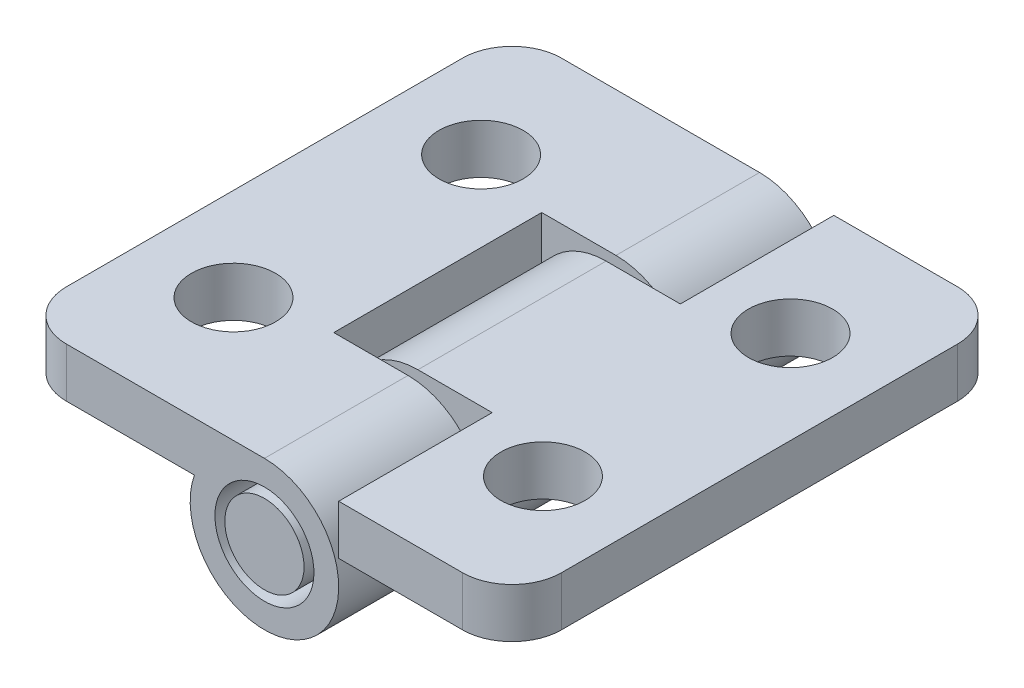
ISO-10303-21;
HEADER;
FILE_DESCRIPTION(('STEP AP214'),'2;1');
FILE_NAME('part.step','',(''),(''),'','','');
FILE_SCHEMA(('AUTOMOTIVE_DESIGN { 1 0 10303 214 1 1 1 1 }'));
ENDSEC;
DATA;
#1=APPLICATION_CONTEXT('core data for automotive mechanical design processes');
#2=APPLICATION_PROTOCOL_DEFINITION('international standard','automotive_design',2000,#1);
#3=PRODUCT_CONTEXT('',#1,'mechanical');
#4=PRODUCT('Part','Part','',(#3));
#5=PRODUCT_RELATED_PRODUCT_CATEGORY('part','',(#4));
#6=PRODUCT_DEFINITION_FORMATION('','',#4);
#7=PRODUCT_DEFINITION_CONTEXT('part definition',#1,'design');
#8=PRODUCT_DEFINITION('design','',#6,#7);
#9=PRODUCT_DEFINITION_SHAPE('','',#8);
#10=(LENGTH_UNIT() NAMED_UNIT(*) SI_UNIT(.MILLI.,.METRE.));
#11=(NAMED_UNIT(*) PLANE_ANGLE_UNIT() SI_UNIT($,.RADIAN.));
#12=(NAMED_UNIT(*) SI_UNIT($,.STERADIAN.) SOLID_ANGLE_UNIT());
#13=UNCERTAINTY_MEASURE_WITH_UNIT(LENGTH_MEASURE(1.E-05),#10,'distance_accuracy_value','');
#14=(GEOMETRIC_REPRESENTATION_CONTEXT(3) GLOBAL_UNCERTAINTY_ASSIGNED_CONTEXT((#13)) GLOBAL_UNIT_ASSIGNED_CONTEXT((#10,
#11,#12)) REPRESENTATION_CONTEXT('',''));
#15=CARTESIAN_POINT('',(0.,0.,0.));
#16=DIRECTION('',(0.,0.,1.));
#17=DIRECTION('',(1.,0.,0.));
#18=AXIS2_PLACEMENT_3D('',#15,#16,#17);
#19=CARTESIAN_POINT('',(204.233210021912,-9.42872218613201,230.693757069305));
#20=DIRECTION('',(0.,0.,1.));
#21=DIRECTION('',(1.,0.,0.));
#22=AXIS2_PLACEMENT_3D('',#19,#20,#21);
#23=PLANE('',#22);
#24=CARTESIAN_POINT('',(204.233210021912,-9.42872218613201,230.693757069305));
#25=DIRECTION('',(0.,0.,-1.));
#26=DIRECTION('',(1.,0.,0.));
#27=AXIS2_PLACEMENT_3D('',#24,#25,#26);
#28=CIRCLE('',#27,2.);
#29=CARTESIAN_POINT('',(206.233210021912,-9.42872218613201,230.693757069305));
#30=VERTEX_POINT('',#29);
#31=EDGE_CURVE('P0_E227',#30,#30,#28,.T.);
#32=ORIENTED_EDGE('',*,*,#31,.T.);
#33=EDGE_LOOP('',(#32));
#34=FACE_BOUND('',#33,.T.);
#35=CARTESIAN_POINT('',(204.233210021912,-9.42872218613201,230.693757069305));
#36=DIRECTION('',(0.,0.,1.));
#37=DIRECTION('',(1.,0.,0.));
#38=AXIS2_PLACEMENT_3D('',#35,#36,#37);
#39=CIRCLE('',#38,3.);
#40=CARTESIAN_POINT('',(201.404782897166,-8.42872218613201,230.693757069305));
#41=VERTEX_POINT('',#40);
#42=CARTESIAN_POINT('',(204.233210021912,-6.42872218613202,230.693757069305));
#43=VERTEX_POINT('',#42);
#44=EDGE_CURVE('P0_E235',#41,#43,#39,.T.);
#45=ORIENTED_EDGE('',*,*,#44,.T.);
#46=DIRECTION('',(-1.,0.,0.));
#47=VECTOR('',#46,1.);
#48=CARTESIAN_POINT('',(204.233210021912,-6.42872218613202,230.693757069305));
#49=LINE('',#48,#47);
#50=CARTESIAN_POINT('',(201.233210021912,-6.42872218613201,230.693757069305));
#51=VERTEX_POINT('',#50);
#52=EDGE_CURVE('P0_E112',#43,#51,#49,.T.);
#53=ORIENTED_EDGE('',*,*,#52,.T.);
#54=DIRECTION('',(0.,-1.,0.));
#55=VECTOR('',#54,1.);
#56=CARTESIAN_POINT('',(201.233210021912,-6.42872218613201,230.693757069305));
#57=LINE('',#56,#55);
#58=CARTESIAN_POINT('',(201.233210021912,-8.42872218613201,230.693757069305));
#59=VERTEX_POINT('',#58);
#60=EDGE_CURVE('P0_E11',#51,#59,#57,.T.);
#61=ORIENTED_EDGE('',*,*,#60,.T.);
#62=DIRECTION('',(1.,0.,0.));
#63=VECTOR('',#62,1.);
#64=CARTESIAN_POINT('',(201.233210021912,-8.42872218613201,230.693757069305));
#65=LINE('',#64,#63);
#66=EDGE_CURVE('P0_E253',#59,#41,#65,.T.);
#67=ORIENTED_EDGE('',*,*,#66,.T.);
#68=EDGE_LOOP('',(#45,#53,#61,#67));
#69=FACE_BOUND('',#68,.T.);
#70=ADVANCED_FACE('P0_F16',(#34,#69),#23,.T.);
#71=CARTESIAN_POINT('',(204.233210021912,-9.42872218613201,239.093757069305));
#72=DIRECTION('',(0.,0.,-1.));
#73=DIRECTION('',(-1.,0.,0.));
#74=AXIS2_PLACEMENT_3D('',#71,#72,#73);
#75=PLANE('',#74);
#76=CARTESIAN_POINT('',(204.233210021912,-9.42872218613201,239.093757069305));
#77=DIRECTION('',(0.,0.,1.));
#78=DIRECTION('',(0.,1.,0.));
#79=AXIS2_PLACEMENT_3D('',#76,#77,#78);
#80=CIRCLE('',#79,2.);
#81=CARTESIAN_POINT('',(204.233210021912,-7.42872218613202,239.093757069305));
#82=VERTEX_POINT('',#81);
#83=EDGE_CURVE('P0_E164',#82,#82,#80,.T.);
#84=ORIENTED_EDGE('',*,*,#83,.T.);
#85=EDGE_LOOP('',(#84));
#86=FACE_BOUND('',#85,.T.);
#87=CARTESIAN_POINT('',(204.233210021912,-9.42872218613201,239.093757069305));
#88=DIRECTION('',(0.,0.,-1.));
#89=DIRECTION('',(0.,1.,0.));
#90=AXIS2_PLACEMENT_3D('',#87,#88,#89);
#91=CIRCLE('',#90,3.);
#92=CARTESIAN_POINT('',(204.233210021912,-6.42872218613202,239.093757069305));
#93=VERTEX_POINT('',#92);
#94=CARTESIAN_POINT('',(201.404782897166,-8.428722186132,239.093757069305));
#95=VERTEX_POINT('',#94);
#96=EDGE_CURVE('P0_E210',#93,#95,#91,.T.);
#97=ORIENTED_EDGE('',*,*,#96,.T.);
#98=DIRECTION('',(-1.,0.,0.));
#99=VECTOR('',#98,1.);
#100=CARTESIAN_POINT('',(201.404782897166,-8.428722186132,239.093757069305));
#101=LINE('',#100,#99);
#102=CARTESIAN_POINT('',(201.233210021912,-8.428722186132,239.093757069305));
#103=VERTEX_POINT('',#102);
#104=EDGE_CURVE('P0_E198',#95,#103,#101,.T.);
#105=ORIENTED_EDGE('',*,*,#104,.T.);
#106=DIRECTION('',(0.,1.,0.));
#107=VECTOR('',#106,1.);
#108=CARTESIAN_POINT('',(201.233210021912,-8.428722186132,239.093757069305));
#109=LINE('',#108,#107);
#110=CARTESIAN_POINT('',(201.233210021912,-6.42872218613201,239.093757069305));
#111=VERTEX_POINT('',#110);
#112=EDGE_CURVE('P0_E27',#103,#111,#109,.T.);
#113=ORIENTED_EDGE('',*,*,#112,.T.);
#114=DIRECTION('',(1.,0.,0.));
#115=VECTOR('',#114,1.);
#116=CARTESIAN_POINT('',(201.233210021912,-6.42872218613201,239.093757069305));
#117=LINE('',#116,#115);
#118=EDGE_CURVE('P0_E247',#111,#93,#117,.T.);
#119=ORIENTED_EDGE('',*,*,#118,.T.);
#120=EDGE_LOOP('',(#97,#105,#113,#119));
#121=FACE_BOUND('',#120,.T.);
#122=ADVANCED_FACE('P0_F165',(#86,#121),#75,.T.);
#123=CARTESIAN_POINT('',(201.233210021912,0.,0.));
#124=DIRECTION('',(-1.,0.,0.));
#125=DIRECTION('',(0.,0.,1.));
#126=AXIS2_PLACEMENT_3D('',#123,#124,#125);
#127=PLANE('',#126);
#128=DIRECTION('',(0.,0.,1.));
#129=VECTOR('',#128,1.);
#130=CARTESIAN_POINT('',(201.233210021912,-6.42872218613201,230.893757069306));
#131=LINE('',#130,#129);
#132=EDGE_CURVE('P0_E244',#51,#111,#131,.T.);
#133=ORIENTED_EDGE('',*,*,#132,.T.);
#134=ORIENTED_EDGE('',*,*,#112,.F.);
#135=DIRECTION('',(0.,0.,-1.));
#136=VECTOR('',#135,1.);
#137=CARTESIAN_POINT('',(201.233210021912,-8.428722186132,238.893757069306));
#138=LINE('',#137,#136);
#139=EDGE_CURVE('P0_E185',#103,#59,#138,.T.);
#140=ORIENTED_EDGE('',*,*,#139,.T.);
#141=ORIENTED_EDGE('',*,*,#60,.F.);
#142=EDGE_LOOP('',(#133,#134,#140,#141));
#143=FACE_BOUND('',#142,.T.);
#144=ADVANCED_FACE('P0_F376',(#143),#127,.F.);
#145=CARTESIAN_POINT('',(196.233210021912,-8.42872218613201,224.893757069306));
#146=DIRECTION('',(0.,0.,1.));
#147=DIRECTION('',(0.,-1.,0.));
#148=AXIS2_PLACEMENT_3D('',#145,#146,#147);
#149=PLANE('',#148);
#150=CARTESIAN_POINT('',(204.233210021912,-9.42872218613201,224.893757069306));
#151=DIRECTION('',(0.,0.,-1.));
#152=DIRECTION('',(0.,1.,0.));
#153=AXIS2_PLACEMENT_3D('',#150,#151,#152);
#154=CIRCLE('',#153,2.);
#155=CARTESIAN_POINT('',(204.233210021912,-7.42872218613202,224.893757069306));
#156=VERTEX_POINT('',#155);
#157=EDGE_CURVE('P0_E211',#156,#156,#154,.T.);
#158=ORIENTED_EDGE('',*,*,#157,.F.);
#159=EDGE_LOOP('',(#158));
#160=FACE_BOUND('',#159,.T.);
#161=DIRECTION('',(1.,0.,0.));
#162=VECTOR('',#161,1.);
#163=CARTESIAN_POINT('',(196.233210021912,-6.42872218613201,224.893757069306));
#164=LINE('',#163,#162);
#165=CARTESIAN_POINT('',(196.233210021912,-6.42872218613201,224.893757069306));
#166=VERTEX_POINT('',#165);
#167=CARTESIAN_POINT('',(204.233210021912,-6.42872218613201,224.893757069306));
#168=VERTEX_POINT('',#167);
#169=EDGE_CURVE('P0_E99',#166,#168,#164,.T.);
#170=ORIENTED_EDGE('',*,*,#169,.T.);
#171=CARTESIAN_POINT('',(204.233210021912,-9.42872218613201,224.893757069306));
#172=DIRECTION('',(0.,0.,-1.));
#173=DIRECTION('',(0.,1.,0.));
#174=AXIS2_PLACEMENT_3D('',#171,#172,#173);
#175=CIRCLE('',#174,3.);
#176=CARTESIAN_POINT('',(201.404782897166,-8.42872218613201,224.893757069306));
#177=VERTEX_POINT('',#176);
#178=EDGE_CURVE('P0_E224',#168,#177,#175,.T.);
#179=ORIENTED_EDGE('',*,*,#178,.T.);
#180=DIRECTION('',(1.,0.,0.));
#181=VECTOR('',#180,1.);
#182=CARTESIAN_POINT('',(196.233210021912,-8.42872218613201,224.893757069306));
#183=LINE('',#182,#181);
#184=CARTESIAN_POINT('',(196.233210021912,-8.42872218613201,224.893757069306));
#185=VERTEX_POINT('',#184);
#186=EDGE_CURVE('P0_E197',#185,#177,#183,.T.);
#187=ORIENTED_EDGE('',*,*,#186,.F.);
#188=DIRECTION('',(0.,1.,0.));
#189=VECTOR('',#188,1.);
#190=CARTESIAN_POINT('',(196.233210021912,-8.42872218613201,224.893757069306));
#191=LINE('',#190,#189);
#192=EDGE_CURVE('P0_E214',#185,#166,#191,.T.);
#193=ORIENTED_EDGE('',*,*,#192,.T.);
#194=EDGE_LOOP('',(#170,#179,#187,#193));
#195=FACE_BOUND('',#194,.T.);
#196=ADVANCED_FACE('P0_F285',(#160,#195),#149,.F.);
#197=CARTESIAN_POINT('',(196.233210021912,-8.42872218613201,244.893757069306));
#198=DIRECTION('',(0.,0.,-1.));
#199=DIRECTION('',(-1.,0.,0.));
#200=AXIS2_PLACEMENT_3D('',#197,#198,#199);
#201=PLANE('',#200);
#202=CARTESIAN_POINT('',(204.233210021912,-9.42872218613201,244.893757069306));
#203=DIRECTION('',(0.,0.,1.));
#204=DIRECTION('',(0.,1.,0.));
#205=AXIS2_PLACEMENT_3D('',#202,#203,#204);
#206=CIRCLE('',#205,2.);
#207=CARTESIAN_POINT('',(204.233210021912,-7.42872218613202,244.893757069306));
#208=VERTEX_POINT('',#207);
#209=EDGE_CURVE('P0_E169',#208,#208,#206,.T.);
#210=ORIENTED_EDGE('',*,*,#209,.F.);
#211=EDGE_LOOP('',(#210));
#212=FACE_BOUND('',#211,.T.);
#213=DIRECTION('',(-1.,0.,0.));
#214=VECTOR('',#213,1.);
#215=CARTESIAN_POINT('',(196.233210021912,-8.42872218613201,244.893757069306));
#216=LINE('',#215,#214);
#217=CARTESIAN_POINT('',(201.404782897166,-8.42872218613201,244.893757069306));
#218=VERTEX_POINT('',#217);
#219=CARTESIAN_POINT('',(196.233210021912,-8.42872218613201,244.893757069306));
#220=VERTEX_POINT('',#219);
#221=EDGE_CURVE('P0_E193',#218,#220,#216,.T.);
#222=ORIENTED_EDGE('',*,*,#221,.F.);
#223=CARTESIAN_POINT('',(204.233210021912,-9.42872218613201,244.893757069306));
#224=DIRECTION('',(0.,0.,1.));
#225=DIRECTION('',(0.,1.,0.));
#226=AXIS2_PLACEMENT_3D('',#223,#224,#225);
#227=CIRCLE('',#226,3.);
#228=CARTESIAN_POINT('',(204.233210021912,-6.42872218613202,244.893757069306));
#229=VERTEX_POINT('',#228);
#230=EDGE_CURVE('P0_E170',#218,#229,#227,.T.);
#231=ORIENTED_EDGE('',*,*,#230,.T.);
#232=DIRECTION('',(-1.,0.,0.));
#233=VECTOR('',#232,1.);
#234=CARTESIAN_POINT('',(196.233210021912,-6.42872218613201,244.893757069306));
#235=LINE('',#234,#233);
#236=CARTESIAN_POINT('',(196.233210021912,-6.42872218613201,244.893757069306));
#237=VERTEX_POINT('',#236);
#238=EDGE_CURVE('P0_E245',#229,#237,#235,.T.);
#239=ORIENTED_EDGE('',*,*,#238,.T.);
#240=DIRECTION('',(0.,1.,0.));
#241=VECTOR('',#240,1.);
#242=CARTESIAN_POINT('',(196.233210021912,-8.42872218613201,244.893757069306));
#243=LINE('',#242,#241);
#244=EDGE_CURVE('P0_E249',#220,#237,#243,.T.);
#245=ORIENTED_EDGE('',*,*,#244,.F.);
#246=EDGE_LOOP('',(#222,#231,#239,#245));
#247=FACE_BOUND('',#246,.T.);
#248=ADVANCED_FACE('P0_F325',(#212,#247),#201,.F.);
#249=CARTESIAN_POINT('',(196.233210021912,-8.42872218613201,226.893757069306));
#250=DIRECTION('',(0.,-1.,0.));
#251=DIRECTION('',(0.,0.,-1.));
#252=AXIS2_PLACEMENT_3D('',#249,#250,#251);
#253=PLANE('',#252);
#254=CARTESIAN_POINT('',(197.983210021912,-8.42872218613201,229.893757069306));
#255=DIRECTION('',(0.,-1.,0.));
#256=DIRECTION('',(0.,0.,-1.));
#257=AXIS2_PLACEMENT_3D('',#254,#255,#256);
#258=CIRCLE('',#257,1.7);
#259=CARTESIAN_POINT('',(197.983210021912,-8.42872218613201,228.193757069305));
#260=VERTEX_POINT('',#259);
#261=EDGE_CURVE('P0_E144',#260,#260,#258,.T.);
#262=ORIENTED_EDGE('',*,*,#261,.F.);
#263=EDGE_LOOP('',(#262));
#264=FACE_BOUND('',#263,.T.);
#265=CARTESIAN_POINT('',(197.983210021912,-8.42872218613201,239.893757069306));
#266=DIRECTION('',(0.,-1.,0.));
#267=DIRECTION('',(0.,0.,-1.));
#268=AXIS2_PLACEMENT_3D('',#265,#266,#267);
#269=CIRCLE('',#268,1.7);
#270=CARTESIAN_POINT('',(197.983210021912,-8.42872218613201,238.193757069306));
#271=VERTEX_POINT('',#270);
#272=EDGE_CURVE('P0_E189',#271,#271,#269,.T.);
#273=ORIENTED_EDGE('',*,*,#272,.F.);
#274=EDGE_LOOP('',(#273));
#275=FACE_BOUND('',#274,.T.);
#276=ORIENTED_EDGE('',*,*,#66,.F.);
#277=ORIENTED_EDGE('',*,*,#139,.F.);
#278=ORIENTED_EDGE('',*,*,#104,.F.);
#279=DIRECTION('',(0.,0.,-1.));
#280=VECTOR('',#279,1.);
#281=CARTESIAN_POINT('',(201.404782897166,-8.42872218613202,253.379038443544));
#282=LINE('',#281,#280);
#283=EDGE_CURVE('P0_E206',#218,#95,#282,.T.);
#284=ORIENTED_EDGE('',*,*,#283,.F.);
#285=ORIENTED_EDGE('',*,*,#221,.T.);
#286=CARTESIAN_POINT('',(196.233210021912,-8.42872218613201,242.893757069305));
#287=DIRECTION('',(0.,-1.,0.));
#288=DIRECTION('',(0.,0.,-1.));
#289=AXIS2_PLACEMENT_3D('',#286,#287,#288);
#290=CIRCLE('',#289,2.);
#291=CARTESIAN_POINT('',(194.233210021912,-8.42872218613201,242.893757069305));
#292=VERTEX_POINT('',#291);
#293=EDGE_CURVE('P0_E20',#220,#292,#290,.T.);
#294=ORIENTED_EDGE('',*,*,#293,.T.);
#295=DIRECTION('',(0.,0.,-1.));
#296=VECTOR('',#295,1.);
#297=CARTESIAN_POINT('',(194.233210021912,-8.42872218613201,242.893757069305));
#298=LINE('',#297,#296);
#299=CARTESIAN_POINT('',(194.233210021912,-8.42872218613201,226.893757069306));
#300=VERTEX_POINT('',#299);
#301=EDGE_CURVE('P0_E203',#292,#300,#298,.T.);
#302=ORIENTED_EDGE('',*,*,#301,.T.);
#303=CARTESIAN_POINT('',(196.233210021912,-8.42872218613201,226.893757069306));
#304=DIRECTION('',(0.,-1.,0.));
#305=DIRECTION('',(0.,0.,-1.));
#306=AXIS2_PLACEMENT_3D('',#303,#304,#305);
#307=CIRCLE('',#306,2.);
#308=EDGE_CURVE('P0_E217',#300,#185,#307,.T.);
#309=ORIENTED_EDGE('',*,*,#308,.T.);
#310=ORIENTED_EDGE('',*,*,#186,.T.);
#311=DIRECTION('',(0.,0.,-1.));
#312=VECTOR('',#311,1.);
#313=CARTESIAN_POINT('',(201.404782897166,-8.42872218613202,253.379038443544));
#314=LINE('',#313,#312);
#315=EDGE_CURVE('P0_E228',#41,#177,#314,.T.);
#316=ORIENTED_EDGE('',*,*,#315,.F.);
#317=EDGE_LOOP('',(#276,#277,#278,#284,#285,#294,#302,#309,#310,#316));
#318=FACE_BOUND('',#317,.T.);
#319=ADVANCED_FACE('P0_F18',(#264,#275,#318),#253,.T.);
#320=CARTESIAN_POINT('',(196.233210021912,-6.42872218613201,226.893757069306));
#321=DIRECTION('',(0.,-1.,0.));
#322=DIRECTION('',(0.,0.,-1.));
#323=AXIS2_PLACEMENT_3D('',#320,#321,#322);
#324=PLANE('',#323);
#325=CARTESIAN_POINT('',(197.983210021912,-6.42872218613201,229.893757069306));
#326=DIRECTION('',(0.,-1.,0.));
#327=DIRECTION('',(0.,0.,-1.));
#328=AXIS2_PLACEMENT_3D('',#325,#326,#327);
#329=CIRCLE('',#328,1.7);
#330=CARTESIAN_POINT('',(197.983210021912,-6.42872218613201,228.193757069305));
#331=VERTEX_POINT('',#330);
#332=EDGE_CURVE('P0_E154',#331,#331,#329,.T.);
#333=ORIENTED_EDGE('',*,*,#332,.T.);
#334=EDGE_LOOP('',(#333));
#335=FACE_BOUND('',#334,.T.);
#336=CARTESIAN_POINT('',(197.983210021912,-6.42872218613201,239.893757069306));
#337=DIRECTION('',(0.,-1.,0.));
#338=DIRECTION('',(0.,0.,-1.));
#339=AXIS2_PLACEMENT_3D('',#336,#337,#338);
#340=CIRCLE('',#339,1.7);
#341=CARTESIAN_POINT('',(197.983210021912,-6.42872218613201,238.193757069306));
#342=VERTEX_POINT('',#341);
#343=EDGE_CURVE('P0_E187',#342,#342,#340,.T.);
#344=ORIENTED_EDGE('',*,*,#343,.T.);
#345=EDGE_LOOP('',(#344));
#346=FACE_BOUND('',#345,.T.);
#347=ORIENTED_EDGE('',*,*,#132,.F.);
#348=ORIENTED_EDGE('',*,*,#52,.F.);
#349=DIRECTION('',(0.,0.,1.));
#350=VECTOR('',#349,1.);
#351=CARTESIAN_POINT('',(204.233210021912,-6.42872218613201,226.893757069306));
#352=LINE('',#351,#350);
#353=EDGE_CURVE('P0_E231',#168,#43,#352,.T.);
#354=ORIENTED_EDGE('',*,*,#353,.F.);
#355=ORIENTED_EDGE('',*,*,#169,.F.);
#356=CARTESIAN_POINT('',(196.233210021912,-6.42872218613201,226.893757069306));
#357=DIRECTION('',(0.,-1.,0.));
#358=DIRECTION('',(0.,0.,-1.));
#359=AXIS2_PLACEMENT_3D('',#356,#357,#358);
#360=CIRCLE('',#359,2.);
#361=CARTESIAN_POINT('',(194.233210021912,-6.42872218613201,226.893757069306));
#362=VERTEX_POINT('',#361);
#363=EDGE_CURVE('P0_E192',#362,#166,#360,.T.);
#364=ORIENTED_EDGE('',*,*,#363,.F.);
#365=DIRECTION('',(0.,0.,-1.));
#366=VECTOR('',#365,1.);
#367=CARTESIAN_POINT('',(194.233210021912,-6.42872218613201,242.893757069305));
#368=LINE('',#367,#366);
#369=CARTESIAN_POINT('',(194.233210021912,-6.42872218613201,242.893757069305));
#370=VERTEX_POINT('',#369);
#371=EDGE_CURVE('P0_E177',#370,#362,#368,.T.);
#372=ORIENTED_EDGE('',*,*,#371,.F.);
#373=CARTESIAN_POINT('',(196.233210021912,-6.42872218613201,242.893757069305));
#374=DIRECTION('',(0.,-1.,0.));
#375=DIRECTION('',(0.,0.,-1.));
#376=AXIS2_PLACEMENT_3D('',#373,#374,#375);
#377=CIRCLE('',#376,2.);
#378=EDGE_CURVE('P0_E238',#237,#370,#377,.T.);
#379=ORIENTED_EDGE('',*,*,#378,.F.);
#380=ORIENTED_EDGE('',*,*,#238,.F.);
#381=DIRECTION('',(0.,0.,1.));
#382=VECTOR('',#381,1.);
#383=CARTESIAN_POINT('',(204.233210021912,-6.42872218613201,226.893757069306));
#384=LINE('',#383,#382);
#385=EDGE_CURVE('P0_E181',#93,#229,#384,.T.);
#386=ORIENTED_EDGE('',*,*,#385,.F.);
#387=ORIENTED_EDGE('',*,*,#118,.F.);
#388=EDGE_LOOP('',(#347,#348,#354,#355,#364,#372,#379,#380,#386,#387));
#389=FACE_BOUND('',#388,.T.);
#390=ADVANCED_FACE('P0_F283',(#335,#346,#389),#324,.F.);
#391=CARTESIAN_POINT('',(196.233210021912,-8.42872218613201,242.893757069305));
#392=DIRECTION('',(0.,1.,0.));
#393=DIRECTION('',(0.,0.,1.));
#394=AXIS2_PLACEMENT_3D('',#391,#392,#393);
#395=CYLINDRICAL_SURFACE('',#394,2.);
#396=ORIENTED_EDGE('',*,*,#378,.T.);
#397=DIRECTION('',(0.,1.,0.));
#398=VECTOR('',#397,1.);
#399=CARTESIAN_POINT('',(194.233210021912,-8.42872218613201,242.893757069305));
#400=LINE('',#399,#398);
#401=EDGE_CURVE('P0_E199',#292,#370,#400,.T.);
#402=ORIENTED_EDGE('',*,*,#401,.F.);
#403=ORIENTED_EDGE('',*,*,#293,.F.);
#404=ORIENTED_EDGE('',*,*,#244,.T.);
#405=EDGE_LOOP('',(#396,#402,#403,#404));
#406=FACE_BOUND('',#405,.T.);
#407=ADVANCED_FACE('P0_F327',(#406),#395,.T.);
#408=CARTESIAN_POINT('',(196.233210021912,-8.42872218613201,226.893757069306));
#409=DIRECTION('',(0.,1.,0.));
#410=DIRECTION('',(0.,0.,1.));
#411=AXIS2_PLACEMENT_3D('',#408,#409,#410);
#412=CYLINDRICAL_SURFACE('',#411,2.);
#413=ORIENTED_EDGE('',*,*,#363,.T.);
#414=ORIENTED_EDGE('',*,*,#192,.F.);
#415=ORIENTED_EDGE('',*,*,#308,.F.);
#416=DIRECTION('',(0.,1.,0.));
#417=VECTOR('',#416,1.);
#418=CARTESIAN_POINT('',(194.233210021912,-8.42872218613201,226.893757069306));
#419=LINE('',#418,#417);
#420=EDGE_CURVE('P0_E218',#300,#362,#419,.T.);
#421=ORIENTED_EDGE('',*,*,#420,.T.);
#422=EDGE_LOOP('',(#413,#414,#415,#421));
#423=FACE_BOUND('',#422,.T.);
#424=ADVANCED_FACE('P0_F279',(#423),#412,.T.);
#425=CARTESIAN_POINT('',(197.983210021912,-8.42872218613201,239.893757069306));
#426=DIRECTION('',(0.,1.,0.));
#427=DIRECTION('',(0.,0.,1.));
#428=AXIS2_PLACEMENT_3D('',#425,#426,#427);
#429=CYLINDRICAL_SURFACE('',#428,1.7);
#430=ORIENTED_EDGE('',*,*,#272,.T.);
#431=EDGE_LOOP('',(#430));
#432=FACE_BOUND('',#431,.T.);
#433=ORIENTED_EDGE('',*,*,#343,.F.);
#434=EDGE_LOOP('',(#433));
#435=FACE_BOUND('',#434,.T.);
#436=ADVANCED_FACE('P0_F365',(#432,#435),#429,.F.);
#437=CARTESIAN_POINT('',(197.983210021912,-8.42872218613201,229.893757069306));
#438=DIRECTION('',(0.,1.,0.));
#439=DIRECTION('',(0.,0.,1.));
#440=AXIS2_PLACEMENT_3D('',#437,#438,#439);
#441=CYLINDRICAL_SURFACE('',#440,1.7);
#442=ORIENTED_EDGE('',*,*,#261,.T.);
#443=EDGE_LOOP('',(#442));
#444=FACE_BOUND('',#443,.T.);
#445=ORIENTED_EDGE('',*,*,#332,.F.);
#446=EDGE_LOOP('',(#445));
#447=FACE_BOUND('',#446,.T.);
#448=ADVANCED_FACE('P0_F399',(#444,#447),#441,.F.);
#449=CARTESIAN_POINT('',(194.233210021912,-8.42872218613201,242.893757069305));
#450=DIRECTION('',(1.,0.,0.));
#451=DIRECTION('',(0.,-1.,0.));
#452=AXIS2_PLACEMENT_3D('',#449,#450,#451);
#453=PLANE('',#452);
#454=ORIENTED_EDGE('',*,*,#371,.T.);
#455=ORIENTED_EDGE('',*,*,#420,.F.);
#456=ORIENTED_EDGE('',*,*,#301,.F.);
#457=ORIENTED_EDGE('',*,*,#401,.T.);
#458=EDGE_LOOP('',(#454,#455,#456,#457));
#459=FACE_BOUND('',#458,.T.);
#460=ADVANCED_FACE('P0_F293',(#459),#453,.F.);
#461=CARTESIAN_POINT('',(204.233210021912,-9.42872218613201,250.550611318798));
#462=DIRECTION('',(0.,0.,-1.));
#463=DIRECTION('',(0.,1.,0.));
#464=AXIS2_PLACEMENT_3D('',#461,#462,#463);
#465=CYLINDRICAL_SURFACE('',#464,2.);
#466=ORIENTED_EDGE('',*,*,#209,.T.);
#467=EDGE_LOOP('',(#466));
#468=FACE_BOUND('',#467,.T.);
#469=ORIENTED_EDGE('',*,*,#83,.F.);
#470=EDGE_LOOP('',(#469));
#471=FACE_BOUND('',#470,.T.);
#472=ADVANCED_FACE('P0_F398',(#468,#471),#465,.F.);
#473=CARTESIAN_POINT('',(204.233210021912,-9.42872218613201,253.379038443544));
#474=DIRECTION('',(0.,0.,-1.));
#475=DIRECTION('',(0.,1.,0.));
#476=AXIS2_PLACEMENT_3D('',#473,#474,#475);
#477=CYLINDRICAL_SURFACE('',#476,3.);
#478=ORIENTED_EDGE('',*,*,#283,.T.);
#479=ORIENTED_EDGE('',*,*,#96,.F.);
#480=ORIENTED_EDGE('',*,*,#385,.T.);
#481=ORIENTED_EDGE('',*,*,#230,.F.);
#482=EDGE_LOOP('',(#478,#479,#480,#481));
#483=FACE_BOUND('',#482,.T.);
#484=ADVANCED_FACE('P0_F317',(#483),#477,.T.);
#485=CARTESIAN_POINT('',(204.233210021912,-9.42872218613201,250.550611318798));
#486=DIRECTION('',(0.,0.,-1.));
#487=DIRECTION('',(0.,1.,0.));
#488=AXIS2_PLACEMENT_3D('',#485,#486,#487);
#489=CYLINDRICAL_SURFACE('',#488,2.);
#490=ORIENTED_EDGE('',*,*,#157,.T.);
#491=EDGE_LOOP('',(#490));
#492=FACE_BOUND('',#491,.T.);
#493=ORIENTED_EDGE('',*,*,#31,.F.);
#494=EDGE_LOOP('',(#493));
#495=FACE_BOUND('',#494,.T.);
#496=ADVANCED_FACE('P0_F423',(#492,#495),#489,.F.);
#497=CARTESIAN_POINT('',(204.233210021912,-9.42872218613201,253.379038443544));
#498=DIRECTION('',(0.,0.,-1.));
#499=DIRECTION('',(0.,1.,0.));
#500=AXIS2_PLACEMENT_3D('',#497,#498,#499);
#501=CYLINDRICAL_SURFACE('',#500,3.);
#502=ORIENTED_EDGE('',*,*,#353,.T.);
#503=ORIENTED_EDGE('',*,*,#44,.F.);
#504=ORIENTED_EDGE('',*,*,#315,.T.);
#505=ORIENTED_EDGE('',*,*,#178,.F.);
#506=EDGE_LOOP('',(#502,#503,#504,#505));
#507=FACE_BOUND('',#506,.T.);
#508=ADVANCED_FACE('P0_F418',(#507),#501,.T.);
#509=CLOSED_SHELL('',(#70,#122,#144,#196,#248,#319,#390,#407,#424,#436,#448,#460,#472,#484,#496,#508));
#510=MANIFOLD_SOLID_BREP('P0_B1',#509);
#511=CARTESIAN_POINT('',(196.233210021912,-8.42872218613201,244.893757069306));
#512=DIRECTION('',(0.,0.,-1.));
#513=DIRECTION('',(-1.,0.,0.));
#514=AXIS2_PLACEMENT_3D('',#511,#512,#513);
#515=PLANE('',#514);
#516=CARTESIAN_POINT('',(204.233210021912,-9.42872218613201,244.893757069306));
#517=DIRECTION('',(0.,0.,1.));
#518=DIRECTION('',(1.,0.,0.));
#519=AXIS2_PLACEMENT_3D('',#516,#517,#518);
#520=CIRCLE('',#519,1.6);
#521=CARTESIAN_POINT('',(205.833210021912,-9.42872218613201,244.893757069306));
#522=VERTEX_POINT('',#521);
#523=EDGE_CURVE('P1_E11',#522,#522,#520,.T.);
#524=ORIENTED_EDGE('',*,*,#523,.T.);
#525=EDGE_LOOP('',(#524));
#526=FACE_BOUND('',#525,.T.);
#527=ADVANCED_FACE('P1_F16',(#526),#515,.F.);
#528=CARTESIAN_POINT('',(204.233210021912,-9.42872218613201,233.602588244763));
#529=DIRECTION('',(0.,0.,1.));
#530=DIRECTION('',(1.,0.,0.));
#531=AXIS2_PLACEMENT_3D('',#528,#529,#530);
#532=CYLINDRICAL_SURFACE('',#531,1.6);
#533=CARTESIAN_POINT('',(204.233210021912,-9.42872218613201,238.693757069306));
#534=DIRECTION('',(0.,0.,-1.));
#535=DIRECTION('',(1.,0.,0.));
#536=AXIS2_PLACEMENT_3D('',#533,#534,#535);
#537=CIRCLE('',#536,1.6);
#538=CARTESIAN_POINT('',(205.833210021912,-9.42872218613201,238.693757069306));
#539=VERTEX_POINT('',#538);
#540=EDGE_CURVE('P1_E178',#539,#539,#537,.T.);
#541=ORIENTED_EDGE('',*,*,#540,.F.);
#542=EDGE_LOOP('',(#541));
#543=FACE_BOUND('',#542,.T.);
#544=ORIENTED_EDGE('',*,*,#523,.F.);
#545=EDGE_LOOP('',(#544));
#546=FACE_BOUND('',#545,.T.);
#547=ADVANCED_FACE('P1_F306',(#543,#546),#532,.T.);
#548=CARTESIAN_POINT('',(196.233210021912,-8.42872218613201,224.893757069306));
#549=DIRECTION('',(0.,0.,1.));
#550=DIRECTION('',(0.,-1.,0.));
#551=AXIS2_PLACEMENT_3D('',#548,#549,#550);
#552=PLANE('',#551);
#553=CARTESIAN_POINT('',(204.233210021912,-9.42872218613201,224.893757069306));
#554=DIRECTION('',(0.,0.,-1.));
#555=DIRECTION('',(0.,1.,0.));
#556=AXIS2_PLACEMENT_3D('',#553,#554,#555);
#557=CIRCLE('',#556,1.6);
#558=CARTESIAN_POINT('',(204.233210021912,-7.82872218613202,224.893757069306));
#559=VERTEX_POINT('',#558);
#560=EDGE_CURVE('P1_E27',#559,#559,#557,.T.);
#561=ORIENTED_EDGE('',*,*,#560,.T.);
#562=EDGE_LOOP('',(#561));
#563=FACE_BOUND('',#562,.T.);
#564=ADVANCED_FACE('P1_F311',(#563),#552,.F.);
#565=CARTESIAN_POINT('',(204.233210021912,-9.42872218613201,236.184925893848));
#566=DIRECTION('',(0.,0.,-1.));
#567=DIRECTION('',(0.,1.,0.));
#568=AXIS2_PLACEMENT_3D('',#565,#566,#567);
#569=CYLINDRICAL_SURFACE('',#568,1.6);
#570=CARTESIAN_POINT('',(204.233210021912,-9.42872218613201,231.093757069306));
#571=DIRECTION('',(0.,0.,1.));
#572=DIRECTION('',(0.,1.,0.));
#573=AXIS2_PLACEMENT_3D('',#570,#571,#572);
#574=CIRCLE('',#573,1.6);
#575=CARTESIAN_POINT('',(204.233210021912,-7.82872218613202,231.093757069306));
#576=VERTEX_POINT('',#575);
#577=EDGE_CURVE('P1_E182',#576,#576,#574,.T.);
#578=ORIENTED_EDGE('',*,*,#577,.F.);
#579=EDGE_LOOP('',(#578));
#580=FACE_BOUND('',#579,.T.);
#581=ORIENTED_EDGE('',*,*,#560,.F.);
#582=EDGE_LOOP('',(#581));
#583=FACE_BOUND('',#582,.T.);
#584=ADVANCED_FACE('P1_F318',(#580,#583),#569,.T.);
#585=CARTESIAN_POINT('',(204.233210021912,-9.42872218613201,231.093757069306));
#586=DIRECTION('',(0.,0.,-1.));
#587=DIRECTION('',(-1.,0.,0.));
#588=AXIS2_PLACEMENT_3D('',#585,#586,#587);
#589=PLANE('',#588);
#590=ORIENTED_EDGE('',*,*,#577,.T.);
#591=EDGE_LOOP('',(#590));
#592=FACE_BOUND('',#591,.T.);
#593=CARTESIAN_POINT('',(204.233210021912,-9.42872218613201,231.093757069306));
#594=DIRECTION('',(0.,0.,-1.));
#595=DIRECTION('',(0.,1.,0.));
#596=AXIS2_PLACEMENT_3D('',#593,#594,#595);
#597=CIRCLE('',#596,3.);
#598=CARTESIAN_POINT('',(207.061637146659,-8.42872218613201,231.093757069306));
#599=VERTEX_POINT('',#598);
#600=CARTESIAN_POINT('',(204.233210021912,-6.42872218613202,231.093757069306));
#601=VERTEX_POINT('',#600);
#602=EDGE_CURVE('P1_E20',#599,#601,#597,.T.);
#603=ORIENTED_EDGE('',*,*,#602,.T.);
#604=DIRECTION('',(1.,0.,0.));
#605=VECTOR('',#604,1.);
#606=CARTESIAN_POINT('',(204.233210021912,-6.42872218613202,231.093757069306));
#607=LINE('',#606,#605);
#608=CARTESIAN_POINT('',(207.233210021912,-6.42872218613201,231.093757069306));
#609=VERTEX_POINT('',#608);
#610=EDGE_CURVE('P1_E162',#601,#609,#607,.T.);
#611=ORIENTED_EDGE('',*,*,#610,.T.);
#612=DIRECTION('',(0.,-1.,0.));
#613=VECTOR('',#612,1.);
#614=CARTESIAN_POINT('',(207.233210021912,-6.42872218613201,231.093757069306));
#615=LINE('',#614,#613);
#616=CARTESIAN_POINT('',(207.233210021912,-8.42872218613201,231.093757069306));
#617=VERTEX_POINT('',#616);
#618=EDGE_CURVE('P1_E154',#609,#617,#615,.T.);
#619=ORIENTED_EDGE('',*,*,#618,.T.);
#620=DIRECTION('',(-1.,0.,0.));
#621=VECTOR('',#620,1.);
#622=CARTESIAN_POINT('',(207.233210021912,-8.42872218613201,231.093757069306));
#623=LINE('',#622,#621);
#624=EDGE_CURVE('P1_E127',#617,#599,#623,.T.);
#625=ORIENTED_EDGE('',*,*,#624,.T.);
#626=EDGE_LOOP('',(#603,#611,#619,#625));
#627=FACE_BOUND('',#626,.T.);
#628=ADVANCED_FACE('P1_F316',(#592,#627),#589,.T.);
#629=CARTESIAN_POINT('',(204.233210021912,-9.42872218613201,238.693757069306));
#630=DIRECTION('',(0.,0.,1.));
#631=DIRECTION('',(1.,0.,0.));
#632=AXIS2_PLACEMENT_3D('',#629,#630,#631);
#633=PLANE('',#632);
#634=ORIENTED_EDGE('',*,*,#540,.T.);
#635=EDGE_LOOP('',(#634));
#636=FACE_BOUND('',#635,.T.);
#637=CARTESIAN_POINT('',(204.233210021912,-9.42872218613201,238.693757069306));
#638=DIRECTION('',(0.,0.,1.));
#639=DIRECTION('',(1.,0.,0.));
#640=AXIS2_PLACEMENT_3D('',#637,#638,#639);
#641=CIRCLE('',#640,3.);
#642=CARTESIAN_POINT('',(204.233210021912,-6.42872218613202,238.693757069306));
#643=VERTEX_POINT('',#642);
#644=CARTESIAN_POINT('',(207.061637146659,-8.428722186132,238.693757069306));
#645=VERTEX_POINT('',#644);
#646=EDGE_CURVE('P1_E214',#643,#645,#641,.T.);
#647=ORIENTED_EDGE('',*,*,#646,.T.);
#648=DIRECTION('',(1.,0.,0.));
#649=VECTOR('',#648,1.);
#650=CARTESIAN_POINT('',(207.061637146659,-8.428722186132,238.693757069306));
#651=LINE('',#650,#649);
#652=CARTESIAN_POINT('',(207.233210021912,-8.42872218613201,238.693757069306));
#653=VERTEX_POINT('',#652);
#654=EDGE_CURVE('P1_E84',#645,#653,#651,.T.);
#655=ORIENTED_EDGE('',*,*,#654,.T.);
#656=DIRECTION('',(0.,1.,0.));
#657=VECTOR('',#656,1.);
#658=CARTESIAN_POINT('',(207.233210021912,-8.42872218613201,238.693757069306));
#659=LINE('',#658,#657);
#660=CARTESIAN_POINT('',(207.233210021912,-6.42872218613201,238.693757069306));
#661=VERTEX_POINT('',#660);
#662=EDGE_CURVE('P1_E157',#653,#661,#659,.T.);
#663=ORIENTED_EDGE('',*,*,#662,.T.);
#664=DIRECTION('',(-1.,0.,0.));
#665=VECTOR('',#664,1.);
#666=CARTESIAN_POINT('',(207.233210021912,-6.42872218613201,238.693757069306));
#667=LINE('',#666,#665);
#668=EDGE_CURVE('P1_E123',#661,#643,#667,.T.);
#669=ORIENTED_EDGE('',*,*,#668,.T.);
#670=EDGE_LOOP('',(#647,#655,#663,#669));
#671=FACE_BOUND('',#670,.T.);
#672=ADVANCED_FACE('P1_F261',(#636,#671),#633,.T.);
#673=CARTESIAN_POINT('',(207.233210021912,-8.42872218613201,230.408475695067));
#674=DIRECTION('',(1.,0.,0.));
#675=DIRECTION('',(0.,1.,0.));
#676=AXIS2_PLACEMENT_3D('',#673,#674,#675);
#677=PLANE('',#676);
#678=DIRECTION('',(0.,0.,1.));
#679=VECTOR('',#678,1.);
#680=CARTESIAN_POINT('',(207.233210021912,-8.42872218613201,230.408475695067));
#681=LINE('',#680,#679);
#682=CARTESIAN_POINT('',(207.233210021912,-8.42872218613201,244.893757069306));
#683=VERTEX_POINT('',#682);
#684=EDGE_CURVE('P1_E132',#653,#683,#681,.T.);
#685=ORIENTED_EDGE('',*,*,#684,.T.);
#686=DIRECTION('',(0.,1.,0.));
#687=VECTOR('',#686,1.);
#688=CARTESIAN_POINT('',(207.233210021912,-8.42872218613201,244.893757069306));
#689=LINE('',#688,#687);
#690=CARTESIAN_POINT('',(207.233210021912,-6.42872218613201,244.893757069306));
#691=VERTEX_POINT('',#690);
#692=EDGE_CURVE('P1_E130',#683,#691,#689,.T.);
#693=ORIENTED_EDGE('',*,*,#692,.T.);
#694=DIRECTION('',(0.,0.,1.));
#695=VECTOR('',#694,1.);
#696=CARTESIAN_POINT('',(207.233210021912,-6.42872218613201,230.408475695067));
#697=LINE('',#696,#695);
#698=EDGE_CURVE('P1_E114',#661,#691,#697,.T.);
#699=ORIENTED_EDGE('',*,*,#698,.F.);
#700=ORIENTED_EDGE('',*,*,#662,.F.);
#701=EDGE_LOOP('',(#685,#693,#699,#700));
#702=FACE_BOUND('',#701,.T.);
#703=ADVANCED_FACE('P1_F131',(#702),#677,.F.);
#704=CARTESIAN_POINT('',(207.233210021912,-6.42872218613201,239.379038443544));
#705=DIRECTION('',(1.,0.,0.));
#706=DIRECTION('',(0.,1.,0.));
#707=AXIS2_PLACEMENT_3D('',#704,#705,#706);
#708=PLANE('',#707);
#709=DIRECTION('',(0.,0.,1.));
#710=VECTOR('',#709,1.);
#711=CARTESIAN_POINT('',(207.233210021912,-8.42872218613201,226.893757069306));
#712=LINE('',#711,#710);
#713=CARTESIAN_POINT('',(207.233210021912,-8.42872218613201,224.893757069306));
#714=VERTEX_POINT('',#713);
#715=EDGE_CURVE('P1_E166',#714,#617,#712,.T.);
#716=ORIENTED_EDGE('',*,*,#715,.T.);
#717=ORIENTED_EDGE('',*,*,#618,.F.);
#718=DIRECTION('',(0.,0.,-1.));
#719=VECTOR('',#718,1.);
#720=CARTESIAN_POINT('',(207.233210021912,-6.42872218613201,239.379038443544));
#721=LINE('',#720,#719);
#722=CARTESIAN_POINT('',(207.233210021912,-6.42872218613201,224.893757069306));
#723=VERTEX_POINT('',#722);
#724=EDGE_CURVE('P1_E158',#609,#723,#721,.T.);
#725=ORIENTED_EDGE('',*,*,#724,.T.);
#726=DIRECTION('',(0.,-1.,0.));
#727=VECTOR('',#726,1.);
#728=CARTESIAN_POINT('',(207.233210021912,-6.42872218613201,224.893757069306));
#729=LINE('',#728,#727);
#730=EDGE_CURVE('P1_E208',#723,#714,#729,.T.);
#731=ORIENTED_EDGE('',*,*,#730,.T.);
#732=EDGE_LOOP('',(#716,#717,#725,#731));
#733=FACE_BOUND('',#732,.T.);
#734=ADVANCED_FACE('P1_F361',(#733),#708,.F.);
#735=CARTESIAN_POINT('',(196.233210021912,-8.42872218613201,226.893757069306));
#736=DIRECTION('',(0.,-1.,0.));
#737=DIRECTION('',(0.,0.,-1.));
#738=AXIS2_PLACEMENT_3D('',#735,#736,#737);
#739=PLANE('',#738);
#740=CARTESIAN_POINT('',(210.483210021912,-8.42872218613201,229.893757069306));
#741=DIRECTION('',(0.,-1.,0.));
#742=DIRECTION('',(0.,0.,-1.));
#743=AXIS2_PLACEMENT_3D('',#740,#741,#742);
#744=CIRCLE('',#743,1.7);
#745=CARTESIAN_POINT('',(210.483210021912,-8.42872218613201,228.193757069305));
#746=VERTEX_POINT('',#745);
#747=EDGE_CURVE('P1_E188',#746,#746,#744,.T.);
#748=ORIENTED_EDGE('',*,*,#747,.F.);
#749=EDGE_LOOP('',(#748));
#750=FACE_BOUND('',#749,.T.);
#751=CARTESIAN_POINT('',(210.483210021912,-8.42872218613201,239.893757069306));
#752=DIRECTION('',(0.,-1.,0.));
#753=DIRECTION('',(0.,0.,-1.));
#754=AXIS2_PLACEMENT_3D('',#751,#752,#753);
#755=CIRCLE('',#754,1.7);
#756=CARTESIAN_POINT('',(210.483210021912,-8.42872218613201,238.193757069306));
#757=VERTEX_POINT('',#756);
#758=EDGE_CURVE('P1_E142',#757,#757,#755,.T.);
#759=ORIENTED_EDGE('',*,*,#758,.F.);
#760=EDGE_LOOP('',(#759));
#761=FACE_BOUND('',#760,.T.);
#762=ORIENTED_EDGE('',*,*,#624,.F.);
#763=ORIENTED_EDGE('',*,*,#715,.F.);
#764=DIRECTION('',(1.,0.,0.));
#765=VECTOR('',#764,1.);
#766=CARTESIAN_POINT('',(196.233210021912,-8.42872218613201,224.893757069306));
#767=LINE('',#766,#765);
#768=CARTESIAN_POINT('',(212.233210021912,-8.42872218613201,224.893757069306));
#769=VERTEX_POINT('',#768);
#770=EDGE_CURVE('P1_E205',#714,#769,#767,.T.);
#771=ORIENTED_EDGE('',*,*,#770,.T.);
#772=CARTESIAN_POINT('',(212.233210021912,-8.42872218613201,226.893757069306));
#773=DIRECTION('',(0.,-1.,0.));
#774=DIRECTION('',(0.,0.,-1.));
#775=AXIS2_PLACEMENT_3D('',#772,#773,#774);
#776=CIRCLE('',#775,2.);
#777=CARTESIAN_POINT('',(214.233210021912,-8.42872218613201,226.893757069306));
#778=VERTEX_POINT('',#777);
#779=EDGE_CURVE('P1_E183',#769,#778,#776,.T.);
#780=ORIENTED_EDGE('',*,*,#779,.T.);
#781=DIRECTION('',(0.,0.,1.));
#782=VECTOR('',#781,1.);
#783=CARTESIAN_POINT('',(214.233210021912,-8.42872218613201,242.893757069305));
#784=LINE('',#783,#782);
#785=CARTESIAN_POINT('',(214.233210021912,-8.42872218613201,242.893757069305));
#786=VERTEX_POINT('',#785);
#787=EDGE_CURVE('P1_E175',#778,#786,#784,.T.);
#788=ORIENTED_EDGE('',*,*,#787,.T.);
#789=CARTESIAN_POINT('',(212.233210021912,-8.42872218613201,242.893757069305));
#790=DIRECTION('',(0.,-1.,0.));
#791=DIRECTION('',(0.,0.,1.));
#792=AXIS2_PLACEMENT_3D('',#789,#790,#791);
#793=CIRCLE('',#792,2.);
#794=CARTESIAN_POINT('',(212.233210021912,-8.42872218613201,244.893757069306));
#795=VERTEX_POINT('',#794);
#796=EDGE_CURVE('P1_E217',#786,#795,#793,.T.);
#797=ORIENTED_EDGE('',*,*,#796,.T.);
#798=DIRECTION('',(-1.,0.,0.));
#799=VECTOR('',#798,1.);
#800=CARTESIAN_POINT('',(196.233210021912,-8.42872218613201,244.893757069306));
#801=LINE('',#800,#799);
#802=EDGE_CURVE('P1_E137',#795,#683,#801,.T.);
#803=ORIENTED_EDGE('',*,*,#802,.T.);
#804=ORIENTED_EDGE('',*,*,#684,.F.);
#805=ORIENTED_EDGE('',*,*,#654,.F.);
#806=DIRECTION('',(0.,0.,1.));
#807=VECTOR('',#806,1.);
#808=CARTESIAN_POINT('',(207.061637146659,-8.42872218613202,253.379038443544));
#809=LINE('',#808,#807);
#810=EDGE_CURVE('P1_E340',#599,#645,#809,.T.);
#811=ORIENTED_EDGE('',*,*,#810,.F.);
#812=EDGE_LOOP('',(#762,#763,#771,#780,#788,#797,#803,#804,#805,#811));
#813=FACE_BOUND('',#812,.T.);
#814=ADVANCED_FACE('P1_F380',(#750,#761,#813),#739,.T.);
#815=CARTESIAN_POINT('',(196.233210021912,-6.42872218613201,226.893757069306));
#816=DIRECTION('',(0.,-1.,0.));
#817=DIRECTION('',(0.,0.,-1.));
#818=AXIS2_PLACEMENT_3D('',#815,#816,#817);
#819=PLANE('',#818);
#820=CARTESIAN_POINT('',(210.483210021912,-6.42872218613201,239.893757069306));
#821=DIRECTION('',(0.,-1.,0.));
#822=DIRECTION('',(0.,0.,-1.));
#823=AXIS2_PLACEMENT_3D('',#820,#821,#822);
#824=CIRCLE('',#823,1.7);
#825=CARTESIAN_POINT('',(210.483210021912,-6.42872218613201,238.193757069306));
#826=VERTEX_POINT('',#825);
#827=EDGE_CURVE('P1_E149',#826,#826,#824,.T.);
#828=ORIENTED_EDGE('',*,*,#827,.T.);
#829=EDGE_LOOP('',(#828));
#830=FACE_BOUND('',#829,.T.);
#831=CARTESIAN_POINT('',(210.483210021912,-6.42872218613201,229.893757069306));
#832=DIRECTION('',(0.,-1.,0.));
#833=DIRECTION('',(0.,0.,-1.));
#834=AXIS2_PLACEMENT_3D('',#831,#832,#833);
#835=CIRCLE('',#834,1.7);
#836=CARTESIAN_POINT('',(210.483210021912,-6.42872218613201,228.193757069305));
#837=VERTEX_POINT('',#836);
#838=EDGE_CURVE('P1_E69',#837,#837,#835,.T.);
#839=ORIENTED_EDGE('',*,*,#838,.T.);
#840=EDGE_LOOP('',(#839));
#841=FACE_BOUND('',#840,.T.);
#842=ORIENTED_EDGE('',*,*,#724,.F.);
#843=ORIENTED_EDGE('',*,*,#610,.F.);
#844=DIRECTION('',(0.,0.,1.));
#845=VECTOR('',#844,1.);
#846=CARTESIAN_POINT('',(204.233210021912,-6.42872218613201,226.893757069306));
#847=LINE('',#846,#845);
#848=EDGE_CURVE('P1_E194',#601,#643,#847,.T.);
#849=ORIENTED_EDGE('',*,*,#848,.T.);
#850=ORIENTED_EDGE('',*,*,#668,.F.);
#851=ORIENTED_EDGE('',*,*,#698,.T.);
#852=DIRECTION('',(-1.,0.,0.));
#853=VECTOR('',#852,1.);
#854=CARTESIAN_POINT('',(196.233210021912,-6.42872218613201,244.893757069306));
#855=LINE('',#854,#853);
#856=CARTESIAN_POINT('',(212.233210021912,-6.42872218613201,244.893757069306));
#857=VERTEX_POINT('',#856);
#858=EDGE_CURVE('P1_E119',#857,#691,#855,.T.);
#859=ORIENTED_EDGE('',*,*,#858,.F.);
#860=CARTESIAN_POINT('',(212.233210021912,-6.42872218613201,242.893757069305));
#861=DIRECTION('',(0.,-1.,0.));
#862=DIRECTION('',(0.,0.,1.));
#863=AXIS2_PLACEMENT_3D('',#860,#861,#862);
#864=CIRCLE('',#863,2.);
#865=CARTESIAN_POINT('',(214.233210021912,-6.42872218613201,242.893757069305));
#866=VERTEX_POINT('',#865);
#867=EDGE_CURVE('P1_E105',#866,#857,#864,.T.);
#868=ORIENTED_EDGE('',*,*,#867,.F.);
#869=DIRECTION('',(0.,0.,1.));
#870=VECTOR('',#869,1.);
#871=CARTESIAN_POINT('',(214.233210021912,-6.42872218613201,242.893757069305));
#872=LINE('',#871,#870);
#873=CARTESIAN_POINT('',(214.233210021912,-6.42872218613201,226.893757069306));
#874=VERTEX_POINT('',#873);
#875=EDGE_CURVE('P1_E197',#874,#866,#872,.T.);
#876=ORIENTED_EDGE('',*,*,#875,.F.);
#877=CARTESIAN_POINT('',(212.233210021912,-6.42872218613201,226.893757069306));
#878=DIRECTION('',(0.,-1.,0.));
#879=DIRECTION('',(0.,0.,-1.));
#880=AXIS2_PLACEMENT_3D('',#877,#878,#879);
#881=CIRCLE('',#880,2.);
#882=CARTESIAN_POINT('',(212.233210021912,-6.42872218613201,224.893757069306));
#883=VERTEX_POINT('',#882);
#884=EDGE_CURVE('P1_E174',#883,#874,#881,.T.);
#885=ORIENTED_EDGE('',*,*,#884,.F.);
#886=DIRECTION('',(1.,0.,0.));
#887=VECTOR('',#886,1.);
#888=CARTESIAN_POINT('',(196.233210021912,-6.42872218613201,224.893757069306));
#889=LINE('',#888,#887);
#890=EDGE_CURVE('P1_E163',#723,#883,#889,.T.);
#891=ORIENTED_EDGE('',*,*,#890,.F.);
#892=EDGE_LOOP('',(#842,#843,#849,#850,#851,#859,#868,#876,#885,#891));
#893=FACE_BOUND('',#892,.T.);
#894=ADVANCED_FACE('P1_F117',(#830,#841,#893),#819,.F.);
#895=CARTESIAN_POINT('',(196.233210021912,-8.42872218613201,224.893757069306));
#896=DIRECTION('',(0.,0.,1.));
#897=DIRECTION('',(0.,-1.,0.));
#898=AXIS2_PLACEMENT_3D('',#895,#896,#897);
#899=PLANE('',#898);
#900=ORIENTED_EDGE('',*,*,#770,.F.);
#901=ORIENTED_EDGE('',*,*,#730,.F.);
#902=ORIENTED_EDGE('',*,*,#890,.T.);
#903=DIRECTION('',(0.,1.,0.));
#904=VECTOR('',#903,1.);
#905=CARTESIAN_POINT('',(212.233210021912,-8.42872218613201,224.893757069306));
#906=LINE('',#905,#904);
#907=EDGE_CURVE('P1_E187',#769,#883,#906,.T.);
#908=ORIENTED_EDGE('',*,*,#907,.F.);
#909=EDGE_LOOP('',(#900,#901,#902,#908));
#910=FACE_BOUND('',#909,.T.);
#911=ADVANCED_FACE('P1_F351',(#910),#899,.F.);
#912=CARTESIAN_POINT('',(212.233210021912,-8.42872218613201,226.893757069306));
#913=DIRECTION('',(0.,1.,0.));
#914=DIRECTION('',(0.,0.,1.));
#915=AXIS2_PLACEMENT_3D('',#912,#913,#914);
#916=CYLINDRICAL_SURFACE('',#915,2.);
#917=ORIENTED_EDGE('',*,*,#884,.T.);
#918=DIRECTION('',(0.,1.,0.));
#919=VECTOR('',#918,1.);
#920=CARTESIAN_POINT('',(214.233210021912,-8.42872218613201,226.893757069306));
#921=LINE('',#920,#919);
#922=EDGE_CURVE('P1_E170',#778,#874,#921,.T.);
#923=ORIENTED_EDGE('',*,*,#922,.F.);
#924=ORIENTED_EDGE('',*,*,#779,.F.);
#925=ORIENTED_EDGE('',*,*,#907,.T.);
#926=EDGE_LOOP('',(#917,#923,#924,#925));
#927=FACE_BOUND('',#926,.T.);
#928=ADVANCED_FACE('P1_F18',(#927),#916,.T.);
#929=CARTESIAN_POINT('',(214.233210021912,-8.42872218613201,242.893757069305));
#930=DIRECTION('',(-1.,0.,0.));
#931=DIRECTION('',(0.,0.,1.));
#932=AXIS2_PLACEMENT_3D('',#929,#930,#931);
#933=PLANE('',#932);
#934=ORIENTED_EDGE('',*,*,#875,.T.);
#935=DIRECTION('',(0.,1.,0.));
#936=VECTOR('',#935,1.);
#937=CARTESIAN_POINT('',(214.233210021912,-8.42872218613201,242.893757069305));
#938=LINE('',#937,#936);
#939=EDGE_CURVE('P1_E201',#786,#866,#938,.T.);
#940=ORIENTED_EDGE('',*,*,#939,.F.);
#941=ORIENTED_EDGE('',*,*,#787,.F.);
#942=ORIENTED_EDGE('',*,*,#922,.T.);
#943=EDGE_LOOP('',(#934,#940,#941,#942));
#944=FACE_BOUND('',#943,.T.);
#945=ADVANCED_FACE('P1_F237',(#944),#933,.F.);
#946=CARTESIAN_POINT('',(212.233210021912,-8.42872218613201,242.893757069305));
#947=DIRECTION('',(0.,1.,0.));
#948=DIRECTION('',(0.,0.,1.));
#949=AXIS2_PLACEMENT_3D('',#946,#947,#948);
#950=CYLINDRICAL_SURFACE('',#949,2.);
#951=ORIENTED_EDGE('',*,*,#867,.T.);
#952=DIRECTION('',(0.,1.,0.));
#953=VECTOR('',#952,1.);
#954=CARTESIAN_POINT('',(212.233210021912,-8.42872218613201,244.893757069306));
#955=LINE('',#954,#953);
#956=EDGE_CURVE('P1_E140',#795,#857,#955,.T.);
#957=ORIENTED_EDGE('',*,*,#956,.F.);
#958=ORIENTED_EDGE('',*,*,#796,.F.);
#959=ORIENTED_EDGE('',*,*,#939,.T.);
#960=EDGE_LOOP('',(#951,#957,#958,#959));
#961=FACE_BOUND('',#960,.T.);
#962=ADVANCED_FACE('P1_F301',(#961),#950,.T.);
#963=CARTESIAN_POINT('',(196.233210021912,-8.42872218613201,244.893757069306));
#964=DIRECTION('',(0.,0.,-1.));
#965=DIRECTION('',(-1.,0.,0.));
#966=AXIS2_PLACEMENT_3D('',#963,#964,#965);
#967=PLANE('',#966);
#968=ORIENTED_EDGE('',*,*,#858,.T.);
#969=ORIENTED_EDGE('',*,*,#692,.F.);
#970=ORIENTED_EDGE('',*,*,#802,.F.);
#971=ORIENTED_EDGE('',*,*,#956,.T.);
#972=EDGE_LOOP('',(#968,#969,#970,#971));
#973=FACE_BOUND('',#972,.T.);
#974=ADVANCED_FACE('P1_F139',(#973),#967,.F.);
#975=CARTESIAN_POINT('',(210.483210021912,-8.42872218613201,239.893757069306));
#976=DIRECTION('',(0.,1.,0.));
#977=DIRECTION('',(0.,0.,1.));
#978=AXIS2_PLACEMENT_3D('',#975,#976,#977);
#979=CYLINDRICAL_SURFACE('',#978,1.7);
#980=ORIENTED_EDGE('',*,*,#758,.T.);
#981=EDGE_LOOP('',(#980));
#982=FACE_BOUND('',#981,.T.);
#983=ORIENTED_EDGE('',*,*,#827,.F.);
#984=EDGE_LOOP('',(#983));
#985=FACE_BOUND('',#984,.T.);
#986=ADVANCED_FACE('P1_F289',(#982,#985),#979,.F.);
#987=CARTESIAN_POINT('',(210.483210021912,-8.42872218613201,229.893757069306));
#988=DIRECTION('',(0.,1.,0.));
#989=DIRECTION('',(0.,0.,1.));
#990=AXIS2_PLACEMENT_3D('',#987,#988,#989);
#991=CYLINDRICAL_SURFACE('',#990,1.7);
#992=ORIENTED_EDGE('',*,*,#747,.T.);
#993=EDGE_LOOP('',(#992));
#994=FACE_BOUND('',#993,.T.);
#995=ORIENTED_EDGE('',*,*,#838,.F.);
#996=EDGE_LOOP('',(#995));
#997=FACE_BOUND('',#996,.T.);
#998=ADVANCED_FACE('P1_F291',(#994,#997),#991,.F.);
#999=CARTESIAN_POINT('',(204.233210021912,-9.42872218613201,253.379038443544));
#1000=DIRECTION('',(0.,0.,-1.));
#1001=DIRECTION('',(0.,1.,0.));
#1002=AXIS2_PLACEMENT_3D('',#999,#1000,#1001);
#1003=CYLINDRICAL_SURFACE('',#1002,3.);
#1004=ORIENTED_EDGE('',*,*,#848,.F.);
#1005=ORIENTED_EDGE('',*,*,#602,.F.);
#1006=ORIENTED_EDGE('',*,*,#810,.T.);
#1007=ORIENTED_EDGE('',*,*,#646,.F.);
#1008=EDGE_LOOP('',(#1004,#1005,#1006,#1007));
#1009=FACE_BOUND('',#1008,.T.);
#1010=ADVANCED_FACE('P1_F299',(#1009),#1003,.T.);
#1011=CLOSED_SHELL('',(#527,#547,#564,#584,#628,#672,#703,#734,#814,#894,#911,#928,#945,#962,
#974,#986,#998,#1010));
#1012=MANIFOLD_SOLID_BREP('P1_B1',#1011);
#1013=ADVANCED_BREP_SHAPE_REPRESENTATION('',(#18,#510,#1012),#14);
#1014=SHAPE_DEFINITION_REPRESENTATION(#9,#1013);
ENDSEC;
END-ISO-10303-21;
